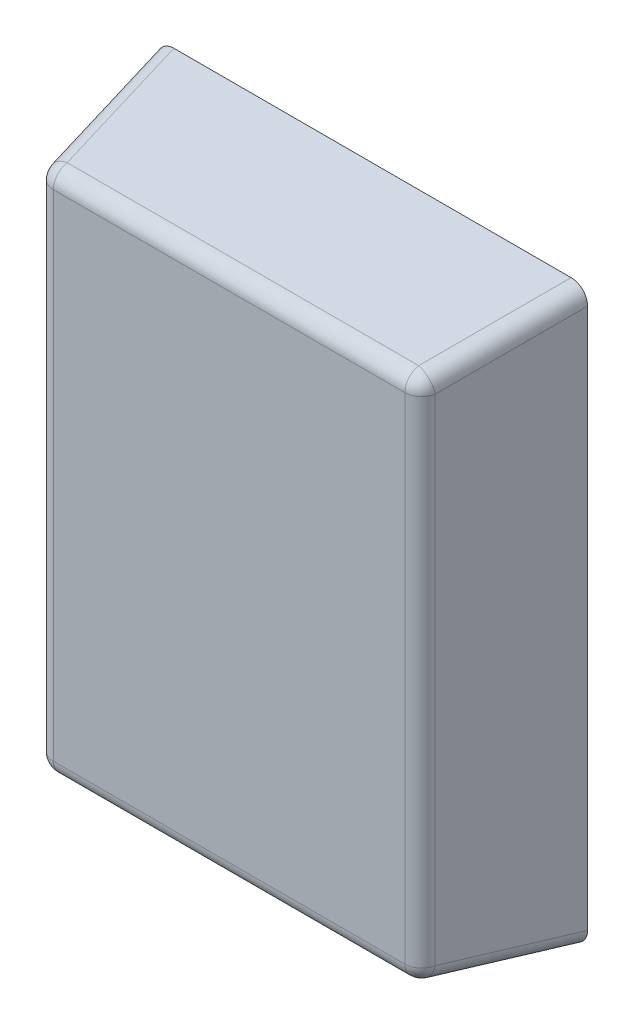
ISO-10303-21;
HEADER;
FILE_DESCRIPTION(('STEP AP214'),'2;1');
FILE_NAME('part.step','',(''),(''),'','','');
FILE_SCHEMA(('AUTOMOTIVE_DESIGN { 1 0 10303 214 1 1 1 1 }'));
ENDSEC;
DATA;
#1=APPLICATION_CONTEXT('core data for automotive mechanical design processes');
#2=APPLICATION_PROTOCOL_DEFINITION('international standard','automotive_design',2000,#1);
#3=PRODUCT_CONTEXT('',#1,'mechanical');
#4=PRODUCT('Part','Part','',(#3));
#5=PRODUCT_RELATED_PRODUCT_CATEGORY('part','',(#4));
#6=PRODUCT_DEFINITION_FORMATION('','',#4);
#7=PRODUCT_DEFINITION_CONTEXT('part definition',#1,'design');
#8=PRODUCT_DEFINITION('design','',#6,#7);
#9=PRODUCT_DEFINITION_SHAPE('','',#8);
#10=(LENGTH_UNIT() NAMED_UNIT(*) SI_UNIT(.MILLI.,.METRE.));
#11=(NAMED_UNIT(*) PLANE_ANGLE_UNIT() SI_UNIT($,.RADIAN.));
#12=(NAMED_UNIT(*) SI_UNIT($,.STERADIAN.) SOLID_ANGLE_UNIT());
#13=UNCERTAINTY_MEASURE_WITH_UNIT(LENGTH_MEASURE(1.E-05),#10,'distance_accuracy_value','');
#14=(GEOMETRIC_REPRESENTATION_CONTEXT(3) GLOBAL_UNCERTAINTY_ASSIGNED_CONTEXT((#13)) GLOBAL_UNIT_ASSIGNED_CONTEXT((#10,
#11,#12)) REPRESENTATION_CONTEXT('',''));
#15=CARTESIAN_POINT('',(0.,0.,0.));
#16=DIRECTION('',(0.,0.,1.));
#17=DIRECTION('',(1.,0.,0.));
#18=AXIS2_PLACEMENT_3D('',#15,#16,#17);
#19=CARTESIAN_POINT('',(-0.205464285309382,-0.641019643054923,0.245));
#20=DIRECTION('',(0.,0.,1.));
#21=DIRECTION('',(1.,0.,0.));
#22=AXIS2_PLACEMENT_3D('',#19,#20,#21);
#23=PLANE('',#22);
#24=DIRECTION('',(0.,1.,0.));
#25=VECTOR('',#24,1.);
#26=CARTESIAN_POINT('',(-0.131917601570131,-0.581022128259369,0.245));
#27=LINE('',#26,#25);
#28=CARTESIAN_POINT('',(-0.131917601570131,-0.537477929724562,0.245));
#29=VERTEX_POINT('',#28);
#30=CARTESIAN_POINT('',(-0.131917601570131,-0.744561356385284,0.245));
#31=VERTEX_POINT('',#30);
#32=EDGE_CURVE('E134',#29,#31,#27,.F.);
#33=ORIENTED_EDGE('',*,*,#32,.F.);
#34=DIRECTION('',(-1.,0.,0.));
#35=VECTOR('',#34,1.);
#36=CARTESIAN_POINT('',(-0.250464285309382,-0.537477929724562,0.245));
#37=LINE('',#36,#35);
#38=CARTESIAN_POINT('',(-0.279010969048634,-0.537477929724562,0.245));
#39=VERTEX_POINT('',#38);
#40=EDGE_CURVE('E237',#39,#29,#37,.F.);
#41=ORIENTED_EDGE('',*,*,#40,.F.);
#42=DIRECTION('',(0.,-1.,0.));
#43=VECTOR('',#42,1.);
#44=CARTESIAN_POINT('',(-0.279010969048634,-0.701017157850478,0.245));
#45=LINE('',#44,#43);
#46=CARTESIAN_POINT('',(-0.279010969048634,-0.744561356385284,0.245));
#47=VERTEX_POINT('',#46);
#48=EDGE_CURVE('E140',#47,#39,#45,.F.);
#49=ORIENTED_EDGE('',*,*,#48,.F.);
#50=DIRECTION('',(1.,0.,0.));
#51=VECTOR('',#50,1.);
#52=CARTESIAN_POINT('',(-0.160464285309382,-0.744561356385284,0.245));
#53=LINE('',#52,#51);
#54=EDGE_CURVE('E114',#31,#47,#53,.F.);
#55=ORIENTED_EDGE('',*,*,#54,.F.);
#56=EDGE_LOOP('',(#33,#41,#49,#55));
#57=FACE_BOUND('',#56,.T.);
#58=ADVANCED_FACE('F17',(#57),#23,.T.);
#59=CARTESIAN_POINT('',(-0.279010969048634,-0.701017157850478,0.238));
#60=DIRECTION('',(0.,-1.,0.));
#61=DIRECTION('',(1.,0.,0.));
#62=AXIS2_PLACEMENT_3D('',#59,#60,#61);
#63=CYLINDRICAL_SURFACE('',#62,0.007);
#64=DIRECTION('',(0.,1.,0.));
#65=VECTOR('',#64,1.);
#66=CARTESIAN_POINT('',(-0.28590462331972,-0.761014672646032,0.239215537243668));
#67=LINE('',#66,#65);
#68=CARTESIAN_POINT('',(-0.28590462331972,-0.744561356385283,0.239215537243668));
#69=VERTEX_POINT('',#68);
#70=CARTESIAN_POINT('',(-0.285904623319719,-0.537477929724562,0.239215537243668));
#71=VERTEX_POINT('',#70);
#72=EDGE_CURVE('E183',#69,#71,#67,.T.);
#73=ORIENTED_EDGE('',*,*,#72,.F.);
#74=CARTESIAN_POINT('',(-0.279010969048635,-0.744561356385283,0.238));
#75=DIRECTION('',(0.,-1.,-1.82015343698568E-13));
#76=DIRECTION('',(1.,0.,0.));
#77=AXIS2_PLACEMENT_3D('',#74,#75,#76);
#78=CIRCLE('',#77,0.007);
#79=EDGE_CURVE('E103',#47,#69,#78,.T.);
#80=ORIENTED_EDGE('',*,*,#79,.F.);
#81=ORIENTED_EDGE('',*,*,#48,.T.);
#82=CARTESIAN_POINT('',(-0.279010969048634,-0.537477929724562,0.238));
#83=DIRECTION('',(0.,-1.,0.));
#84=DIRECTION('',(1.,0.,0.));
#85=AXIS2_PLACEMENT_3D('',#82,#83,#84);
#86=CIRCLE('',#85,0.007);
#87=EDGE_CURVE('E90',#71,#39,#86,.F.);
#88=ORIENTED_EDGE('',*,*,#87,.F.);
#89=EDGE_LOOP('',(#73,#80,#81,#88));
#90=FACE_BOUND('',#89,.T.);
#91=ADVANCED_FACE('F229',(#90),#63,.T.);
#92=CARTESIAN_POINT('',(-0.279010969048635,-0.744561356385283,0.238));
#93=DIRECTION('',(1.,0.,0.));
#94=DIRECTION('',(0.,1.,0.));
#95=AXIS2_PLACEMENT_3D('',#92,#93,#94);
#96=SPHERICAL_SURFACE('',#95,0.007);
#97=ORIENTED_EDGE('',*,*,#79,.T.);
#98=CARTESIAN_POINT('',(-0.279010969048634,-0.744561356385283,0.237999999999999));
#99=DIRECTION('',(-0.171087869746035,-0.171087869746037,-0.970287525247814));
#100=DIRECTION('',(0.,0.984807753012208,-0.173648177666932));
#101=AXIS2_PLACEMENT_3D('',#98,#99,#100);
#102=CIRCLE('',#101,0.007);
#103=CARTESIAN_POINT('',(-0.279010969048635,-0.751455010656369,0.239215537243668));
#104=VERTEX_POINT('',#103);
#105=EDGE_CURVE('E20',#104,#69,#102,.T.);
#106=ORIENTED_EDGE('',*,*,#105,.F.);
#107=CARTESIAN_POINT('',(-0.279010969048634,-0.744561356385284,0.238));
#108=DIRECTION('',(1.,0.,0.));
#109=DIRECTION('',(0.,1.,0.));
#110=AXIS2_PLACEMENT_3D('',#107,#108,#109);
#111=CIRCLE('',#110,0.007);
#112=EDGE_CURVE('E122',#47,#104,#111,.T.);
#113=ORIENTED_EDGE('',*,*,#112,.F.);
#114=EDGE_LOOP('',(#97,#106,#113));
#115=FACE_BOUND('',#114,.T.);
#116=ADVANCED_FACE('F226',(#115),#96,.T.);
#117=CARTESIAN_POINT('',(-0.160464285309382,-0.744561356385284,0.238));
#118=DIRECTION('',(1.,0.,0.));
#119=DIRECTION('',(0.,1.,0.));
#120=AXIS2_PLACEMENT_3D('',#117,#118,#119);
#121=CYLINDRICAL_SURFACE('',#120,0.007);
#122=DIRECTION('',(1.,0.,0.));
#123=VECTOR('',#122,1.);
#124=CARTESIAN_POINT('',(-0.115464285309383,-0.75145501065637,0.239215537243668));
#125=LINE('',#124,#123);
#126=CARTESIAN_POINT('',(-0.131917601570131,-0.751455010656369,0.239215537243668));
#127=VERTEX_POINT('',#126);
#128=EDGE_CURVE('E117',#127,#104,#125,.F.);
#129=ORIENTED_EDGE('',*,*,#128,.F.);
#130=CARTESIAN_POINT('',(-0.131917601570131,-0.744561356385284,0.238));
#131=DIRECTION('',(1.,0.,0.));
#132=DIRECTION('',(0.,1.,0.));
#133=AXIS2_PLACEMENT_3D('',#130,#131,#132);
#134=CIRCLE('',#133,0.00699999999999995);
#135=EDGE_CURVE('E110',#31,#127,#134,.T.);
#136=ORIENTED_EDGE('',*,*,#135,.F.);
#137=ORIENTED_EDGE('',*,*,#54,.T.);
#138=ORIENTED_EDGE('',*,*,#112,.T.);
#139=EDGE_LOOP('',(#129,#136,#137,#138));
#140=FACE_BOUND('',#139,.T.);
#141=ADVANCED_FACE('F112',(#140),#121,.T.);
#142=CARTESIAN_POINT('',(-0.131917601570132,-0.744561356385284,0.238));
#143=DIRECTION('',(1.,0.,0.));
#144=DIRECTION('',(0.,1.,0.));
#145=AXIS2_PLACEMENT_3D('',#142,#143,#144);
#146=SPHERICAL_SURFACE('',#145,0.007);
#147=ORIENTED_EDGE('',*,*,#135,.T.);
#148=CARTESIAN_POINT('',(-0.131917601570132,-0.744561356385283,0.237999999999999));
#149=DIRECTION('',(0.171087869746039,-0.171087869746042,-0.970287525247812));
#150=DIRECTION('',(0.,0.984807753012207,-0.173648177666937));
#151=AXIS2_PLACEMENT_3D('',#148,#149,#150);
#152=CIRCLE('',#151,0.007);
#153=CARTESIAN_POINT('',(-0.125023947299046,-0.744561356385284,0.239215537243668));
#154=VERTEX_POINT('',#153);
#155=EDGE_CURVE('E126',#154,#127,#152,.T.);
#156=ORIENTED_EDGE('',*,*,#155,.F.);
#157=CARTESIAN_POINT('',(-0.131917601570131,-0.744561356385284,0.238));
#158=DIRECTION('',(0.,1.,0.));
#159=DIRECTION('',(-1.,0.,0.));
#160=AXIS2_PLACEMENT_3D('',#157,#158,#159);
#161=CIRCLE('',#160,0.007);
#162=EDGE_CURVE('E121',#31,#154,#161,.T.);
#163=ORIENTED_EDGE('',*,*,#162,.F.);
#164=EDGE_LOOP('',(#147,#156,#163));
#165=FACE_BOUND('',#164,.T.);
#166=ADVANCED_FACE('F125',(#165),#146,.T.);
#167=CARTESIAN_POINT('',(-0.131917601570131,-0.581022128259369,0.238));
#168=DIRECTION('',(0.,1.,0.));
#169=DIRECTION('',(-1.,0.,0.));
#170=AXIS2_PLACEMENT_3D('',#167,#168,#169);
#171=CYLINDRICAL_SURFACE('',#170,0.007);
#172=DIRECTION('',(0.,1.,0.));
#173=VECTOR('',#172,1.);
#174=CARTESIAN_POINT('',(-0.125023947299045,-0.521024613463814,0.239215537243668));
#175=LINE('',#174,#173);
#176=CARTESIAN_POINT('',(-0.125023947299045,-0.537477929724562,0.239215537243668));
#177=VERTEX_POINT('',#176);
#178=EDGE_CURVE('E165',#177,#154,#175,.F.);
#179=ORIENTED_EDGE('',*,*,#178,.F.);
#180=CARTESIAN_POINT('',(-0.131917601570131,-0.537477929724562,0.238));
#181=DIRECTION('',(0.,-1.,0.));
#182=DIRECTION('',(1.,0.,0.));
#183=AXIS2_PLACEMENT_3D('',#180,#181,#182);
#184=CIRCLE('',#183,0.007);
#185=EDGE_CURVE('E131',#29,#177,#184,.F.);
#186=ORIENTED_EDGE('',*,*,#185,.F.);
#187=ORIENTED_EDGE('',*,*,#32,.T.);
#188=ORIENTED_EDGE('',*,*,#162,.T.);
#189=EDGE_LOOP('',(#179,#186,#187,#188));
#190=FACE_BOUND('',#189,.T.);
#191=ADVANCED_FACE('F135',(#190),#171,.T.);
#192=CARTESIAN_POINT('',(-0.131917601570131,-0.537477929724562,0.238));
#193=DIRECTION('',(1.,0.,0.));
#194=DIRECTION('',(0.,1.,0.));
#195=AXIS2_PLACEMENT_3D('',#192,#193,#194);
#196=SPHERICAL_SURFACE('',#195,0.007);
#197=CARTESIAN_POINT('',(-0.131917601570131,-0.537477929724562,0.238));
#198=DIRECTION('',(-1.,0.,0.));
#199=DIRECTION('',(0.,-1.,0.));
#200=AXIS2_PLACEMENT_3D('',#197,#198,#199);
#201=CIRCLE('',#200,0.007);
#202=CARTESIAN_POINT('',(-0.131917601570131,-0.530584275453477,0.239215537243668));
#203=VERTEX_POINT('',#202);
#204=EDGE_CURVE('E216',#29,#203,#201,.T.);
#205=ORIENTED_EDGE('',*,*,#204,.F.);
#206=ORIENTED_EDGE('',*,*,#185,.T.);
#207=CARTESIAN_POINT('',(-0.131917601570131,-0.537477929724563,0.237999999999999));
#208=DIRECTION('',(0.17108786974604,0.171087869746041,-0.970287525247812));
#209=DIRECTION('',(0.,0.984807753012207,0.173648177666936));
#210=AXIS2_PLACEMENT_3D('',#207,#208,#209);
#211=CIRCLE('',#210,0.007);
#212=EDGE_CURVE('E162',#203,#177,#211,.T.);
#213=ORIENTED_EDGE('',*,*,#212,.F.);
#214=EDGE_LOOP('',(#205,#206,#213));
#215=FACE_BOUND('',#214,.T.);
#216=ADVANCED_FACE('F204',(#215),#196,.T.);
#217=CARTESIAN_POINT('',(-0.250464285309382,-0.537477929724562,0.238));
#218=DIRECTION('',(-1.,0.,0.));
#219=DIRECTION('',(0.,-1.,0.));
#220=AXIS2_PLACEMENT_3D('',#217,#218,#219);
#221=CYLINDRICAL_SURFACE('',#220,0.007);
#222=DIRECTION('',(1.,0.,0.));
#223=VECTOR('',#222,1.);
#224=CARTESIAN_POINT('',(-0.295464285309383,-0.530584275453476,0.239215537243668));
#225=LINE('',#224,#223);
#226=CARTESIAN_POINT('',(-0.279010969048634,-0.530584275453477,0.239215537243668));
#227=VERTEX_POINT('',#226);
#228=EDGE_CURVE('E163',#227,#203,#225,.T.);
#229=ORIENTED_EDGE('',*,*,#228,.F.);
#230=CARTESIAN_POINT('',(-0.279010969048634,-0.537477929724562,0.238));
#231=DIRECTION('',(1.,0.,0.));
#232=DIRECTION('',(0.,1.,0.));
#233=AXIS2_PLACEMENT_3D('',#230,#231,#232);
#234=CIRCLE('',#233,0.00699999999999995);
#235=EDGE_CURVE('E98',#39,#227,#234,.F.);
#236=ORIENTED_EDGE('',*,*,#235,.F.);
#237=ORIENTED_EDGE('',*,*,#40,.T.);
#238=ORIENTED_EDGE('',*,*,#204,.T.);
#239=EDGE_LOOP('',(#229,#236,#237,#238));
#240=FACE_BOUND('',#239,.T.);
#241=ADVANCED_FACE('F199',(#240),#221,.T.);
#242=CARTESIAN_POINT('',(-0.279010969048634,-0.537477929724562,0.238));
#243=DIRECTION('',(1.,0.,0.));
#244=DIRECTION('',(0.,1.,0.));
#245=AXIS2_PLACEMENT_3D('',#242,#243,#244);
#246=SPHERICAL_SURFACE('',#245,0.007);
#247=ORIENTED_EDGE('',*,*,#87,.T.);
#248=ORIENTED_EDGE('',*,*,#235,.T.);
#249=CARTESIAN_POINT('',(-0.279010969048634,-0.537477929724562,0.237999999999999));
#250=DIRECTION('',(-0.171087869746029,0.171087869746031,-0.970287525247816));
#251=DIRECTION('',(0.,0.984807753012209,0.173648177666926));
#252=AXIS2_PLACEMENT_3D('',#249,#250,#251);
#253=CIRCLE('',#252,0.007);
#254=EDGE_CURVE('E158',#71,#227,#253,.T.);
#255=ORIENTED_EDGE('',*,*,#254,.F.);
#256=EDGE_LOOP('',(#247,#248,#255));
#257=FACE_BOUND('',#256,.T.);
#258=ADVANCED_FACE('F194',(#257),#246,.T.);
#259=CARTESIAN_POINT('',(-0.295464285309383,-0.761014672646032,0.185));
#260=DIRECTION('',(-0.984807753012208,0.,0.173648177666928));
#261=DIRECTION('',(0.173648177666928,0.,0.984807753012208));
#262=AXIS2_PLACEMENT_3D('',#259,#260,#261);
#263=PLANE('',#262);
#264=DIRECTION('',(-0.171087869746035,-0.171087869746037,-0.970287525247814));
#265=VECTOR('',#264,1.);
#266=CARTESIAN_POINT('',(-0.293031674545797,-0.751688407611361,0.198796021197729));
#267=LINE('',#266,#265);
#268=CARTESIAN_POINT('',(-0.295464285309383,-0.754121018374946,0.185));
#269=VERTEX_POINT('',#268);
#270=EDGE_CURVE('E181',#69,#269,#267,.T.);
#271=ORIENTED_EDGE('',*,*,#270,.F.);
#272=ORIENTED_EDGE('',*,*,#72,.T.);
#273=DIRECTION('',(-0.171087869746032,0.171087869746027,-0.970287525247816));
#274=VECTOR('',#273,1.);
#275=CARTESIAN_POINT('',(-0.285904623319719,-0.537477929724562,0.239215537243668));
#276=LINE('',#275,#274);
#277=CARTESIAN_POINT('',(-0.295464285309383,-0.527918267734899,0.185));
#278=VERTEX_POINT('',#277);
#279=EDGE_CURVE('E186',#71,#278,#276,.T.);
#280=ORIENTED_EDGE('',*,*,#279,.T.);
#281=DIRECTION('',(0.,1.,0.));
#282=VECTOR('',#281,1.);
#283=CARTESIAN_POINT('',(-0.295464285309383,-0.641019643054923,0.185));
#284=LINE('',#283,#282);
#285=EDGE_CURVE('E155',#278,#269,#284,.F.);
#286=ORIENTED_EDGE('',*,*,#285,.T.);
#287=EDGE_LOOP('',(#271,#272,#280,#286));
#288=FACE_BOUND('',#287,.T.);
#289=ADVANCED_FACE('F198',(#288),#263,.T.);
#290=CARTESIAN_POINT('',(-0.286138020274712,-0.751688407611361,0.197580483954061));
#291=DIRECTION('',(-0.171087869746035,-0.171087869746037,-0.970287525247814));
#292=DIRECTION('',(0.,0.984807753012208,-0.173648177666932));
#293=AXIS2_PLACEMENT_3D('',#290,#291,#292);
#294=CYLINDRICAL_SURFACE('',#293,0.007);
#295=DIRECTION('',(-0.17108786974603,-0.171087869746038,-0.970287525247815));
#296=VECTOR('',#295,1.);
#297=CARTESIAN_POINT('',(-0.279010969048635,-0.751455010656369,0.239215537243668));
#298=LINE('',#297,#296);
#299=CARTESIAN_POINT('',(-0.288570631038298,-0.761014672646032,0.185));
#300=VERTEX_POINT('',#299);
#301=EDGE_CURVE('E172',#104,#300,#298,.T.);
#302=ORIENTED_EDGE('',*,*,#301,.F.);
#303=ORIENTED_EDGE('',*,*,#105,.T.);
#304=ORIENTED_EDGE('',*,*,#270,.T.);
#305=CARTESIAN_POINT('',(-0.288356299026183,-0.753906686362832,0.185));
#306=DIRECTION('',(0.,0.,1.));
#307=DIRECTION('',(-0.707106781186543,-0.707106781186552,0.));
#308=AXIS2_PLACEMENT_3D('',#305,#306,#307);
#309=ELLIPSE('',#308,0.00721435638184896,0.007);
#310=EDGE_CURVE('E153',#269,#300,#309,.T.);
#311=ORIENTED_EDGE('',*,*,#310,.T.);
#312=EDGE_LOOP('',(#302,#303,#304,#311));
#313=FACE_BOUND('',#312,.T.);
#314=ADVANCED_FACE('F273',(#313),#294,.T.);
#315=CARTESIAN_POINT('',(-0.115464285309383,-0.761014672646033,0.185));
#316=DIRECTION('',(0.,-0.984807753012208,0.173648177666931));
#317=DIRECTION('',(0.,-0.173648177666931,-0.984807753012208));
#318=AXIS2_PLACEMENT_3D('',#315,#316,#317);
#319=PLANE('',#318);
#320=DIRECTION('',(0.171087869746039,-0.171087869746042,-0.970287525247812));
#321=VECTOR('',#320,1.);
#322=CARTESIAN_POINT('',(-0.125668536630148,-0.757704075596352,0.203775328859929));
#323=LINE('',#322,#321);
#324=CARTESIAN_POINT('',(-0.122357939580468,-0.761014672646032,0.185));
#325=VERTEX_POINT('',#324);
#326=EDGE_CURVE('E166',#127,#325,#323,.T.);
#327=ORIENTED_EDGE('',*,*,#326,.F.);
#328=ORIENTED_EDGE('',*,*,#128,.T.);
#329=ORIENTED_EDGE('',*,*,#301,.T.);
#330=DIRECTION('',(1.,0.,0.));
#331=VECTOR('',#330,1.);
#332=CARTESIAN_POINT('',(-0.205464285309382,-0.761014672646032,0.185));
#333=LINE('',#332,#331);
#334=EDGE_CURVE('E152',#300,#325,#333,.T.);
#335=ORIENTED_EDGE('',*,*,#334,.T.);
#336=EDGE_LOOP('',(#327,#328,#329,#335));
#337=FACE_BOUND('',#336,.T.);
#338=ADVANCED_FACE('F272',(#337),#319,.T.);
#339=CARTESIAN_POINT('',(-0.125668536630148,-0.750810421325267,0.202559791616261));
#340=DIRECTION('',(0.171087869746039,-0.171087869746042,-0.970287525247812));
#341=DIRECTION('',(0.,0.984807753012207,-0.173648177666937));
#342=AXIS2_PLACEMENT_3D('',#339,#340,#341);
#343=CYLINDRICAL_SURFACE('',#342,0.007);
#344=DIRECTION('',(0.171087869746034,-0.171087869746032,-0.970287525247815));
#345=VECTOR('',#344,1.);
#346=CARTESIAN_POINT('',(-0.125023947299046,-0.744561356385284,0.239215537243668));
#347=LINE('',#346,#345);
#348=CARTESIAN_POINT('',(-0.115464285309383,-0.754121018374947,0.185));
#349=VERTEX_POINT('',#348);
#350=EDGE_CURVE('E168',#154,#349,#347,.T.);
#351=ORIENTED_EDGE('',*,*,#350,.F.);
#352=ORIENTED_EDGE('',*,*,#155,.T.);
#353=ORIENTED_EDGE('',*,*,#326,.T.);
#354=CARTESIAN_POINT('',(-0.122572271592583,-0.753906686362832,0.185));
#355=DIRECTION('',(0.,0.,1.));
#356=DIRECTION('',(0.707106781186541,-0.707106781186554,0.));
#357=AXIS2_PLACEMENT_3D('',#354,#355,#356);
#358=ELLIPSE('',#357,0.00721435638184897,0.007);
#359=EDGE_CURVE('E150',#325,#349,#358,.T.);
#360=ORIENTED_EDGE('',*,*,#359,.T.);
#361=EDGE_LOOP('',(#351,#352,#353,#360));
#362=FACE_BOUND('',#361,.T.);
#363=ADVANCED_FACE('F293',(#362),#343,.T.);
#364=CARTESIAN_POINT('',(-0.115464285309382,-0.521024613463814,0.185));
#365=DIRECTION('',(0.984807753012208,0.,0.173648177666929));
#366=DIRECTION('',(0.173648177666929,0.,-0.984807753012208));
#367=AXIS2_PLACEMENT_3D('',#364,#365,#366);
#368=PLANE('',#367);
#369=ORIENTED_EDGE('',*,*,#350,.T.);
#370=DIRECTION('',(0.,1.,0.));
#371=VECTOR('',#370,1.);
#372=CARTESIAN_POINT('',(-0.115464285309383,-0.641019643054923,0.185));
#373=LINE('',#372,#371);
#374=CARTESIAN_POINT('',(-0.115464285309382,-0.527918267734899,0.185));
#375=VERTEX_POINT('',#374);
#376=EDGE_CURVE('E149',#349,#375,#373,.T.);
#377=ORIENTED_EDGE('',*,*,#376,.T.);
#378=DIRECTION('',(0.17108786974604,0.171087869746041,-0.970287525247812));
#379=VECTOR('',#378,1.);
#380=CARTESIAN_POINT('',(-0.117896896072968,-0.530350878498484,0.19879602119773));
#381=LINE('',#380,#379);
#382=EDGE_CURVE('E164',#177,#375,#381,.T.);
#383=ORIENTED_EDGE('',*,*,#382,.F.);
#384=ORIENTED_EDGE('',*,*,#178,.T.);
#385=EDGE_LOOP('',(#369,#377,#383,#384));
#386=FACE_BOUND('',#385,.T.);
#387=ADVANCED_FACE('F267',(#386),#368,.T.);
#388=CARTESIAN_POINT('',(-0.124790550344053,-0.530350878498485,0.197580483954061));
#389=DIRECTION('',(0.17108786974604,0.171087869746041,-0.970287525247812));
#390=DIRECTION('',(0.,0.984807753012207,0.173648177666936));
#391=AXIS2_PLACEMENT_3D('',#388,#389,#390);
#392=CYLINDRICAL_SURFACE('',#391,0.007);
#393=DIRECTION('',(0.17108786974603,0.171087869746036,-0.970287525247815));
#394=VECTOR('',#393,1.);
#395=CARTESIAN_POINT('',(-0.131917601570131,-0.530584275453476,0.239215537243668));
#396=LINE('',#395,#394);
#397=CARTESIAN_POINT('',(-0.122357939580468,-0.521024613463814,0.185));
#398=VERTEX_POINT('',#397);
#399=EDGE_CURVE('E161',#203,#398,#396,.T.);
#400=ORIENTED_EDGE('',*,*,#399,.F.);
#401=ORIENTED_EDGE('',*,*,#212,.T.);
#402=ORIENTED_EDGE('',*,*,#382,.T.);
#403=CARTESIAN_POINT('',(-0.122572271592582,-0.528132599747014,0.185));
#404=DIRECTION('',(0.,0.,1.));
#405=DIRECTION('',(0.707106781186545,0.70710678118655,0.));
#406=AXIS2_PLACEMENT_3D('',#403,#404,#405);
#407=ELLIPSE('',#406,0.00721435638184897,0.007);
#408=EDGE_CURVE('E26',#375,#398,#407,.T.);
#409=ORIENTED_EDGE('',*,*,#408,.T.);
#410=EDGE_LOOP('',(#400,#401,#402,#409));
#411=FACE_BOUND('',#410,.T.);
#412=ADVANCED_FACE('F257',(#411),#392,.T.);
#413=CARTESIAN_POINT('',(-0.295464285309383,-0.521024613463813,0.185));
#414=DIRECTION('',(0.,0.984807753012208,0.17364817766693));
#415=DIRECTION('',(0.,-0.17364817766693,0.984807753012208));
#416=AXIS2_PLACEMENT_3D('',#413,#414,#415);
#417=PLANE('',#416);
#418=ORIENTED_EDGE('',*,*,#399,.T.);
#419=DIRECTION('',(1.,0.,0.));
#420=VECTOR('',#419,1.);
#421=CARTESIAN_POINT('',(-0.205464285309382,-0.521024613463814,0.185));
#422=LINE('',#421,#420);
#423=CARTESIAN_POINT('',(-0.288570631038297,-0.521024613463814,0.185));
#424=VERTEX_POINT('',#423);
#425=EDGE_CURVE('E11',#398,#424,#422,.F.);
#426=ORIENTED_EDGE('',*,*,#425,.T.);
#427=DIRECTION('',(-0.171087869746029,0.171087869746031,-0.970287525247816));
#428=VECTOR('',#427,1.);
#429=CARTESIAN_POINT('',(-0.285260033988617,-0.524335210513494,0.203775328859929));
#430=LINE('',#429,#428);
#431=EDGE_CURVE('E157',#227,#424,#430,.T.);
#432=ORIENTED_EDGE('',*,*,#431,.F.);
#433=ORIENTED_EDGE('',*,*,#228,.T.);
#434=EDGE_LOOP('',(#418,#426,#432,#433));
#435=FACE_BOUND('',#434,.T.);
#436=ADVANCED_FACE('F254',(#435),#417,.T.);
#437=CARTESIAN_POINT('',(-0.285260033988617,-0.531228864784579,0.202559791616261));
#438=DIRECTION('',(-0.171087869746029,0.171087869746031,-0.970287525247816));
#439=DIRECTION('',(0.,0.984807753012209,0.173648177666926));
#440=AXIS2_PLACEMENT_3D('',#437,#438,#439);
#441=CYLINDRICAL_SURFACE('',#440,0.007);
#442=ORIENTED_EDGE('',*,*,#431,.T.);
#443=CARTESIAN_POINT('',(-0.288356299026182,-0.528132599747014,0.185));
#444=DIRECTION('',(0.,0.,1.));
#445=DIRECTION('',(-0.707106781186543,0.707106781186552,0.));
#446=AXIS2_PLACEMENT_3D('',#443,#444,#445);
#447=ELLIPSE('',#446,0.00721435638184894,0.007);
#448=EDGE_CURVE('E35',#424,#278,#447,.T.);
#449=ORIENTED_EDGE('',*,*,#448,.T.);
#450=ORIENTED_EDGE('',*,*,#279,.F.);
#451=ORIENTED_EDGE('',*,*,#254,.T.);
#452=EDGE_LOOP('',(#442,#449,#450,#451));
#453=FACE_BOUND('',#452,.T.);
#454=ADVANCED_FACE('F278',(#453),#441,.T.);
#455=CARTESIAN_POINT('',(-0.205464285309382,-0.641019643054923,0.185));
#456=DIRECTION('',(0.,0.,1.));
#457=DIRECTION('',(1.,0.,0.));
#458=AXIS2_PLACEMENT_3D('',#455,#456,#457);
#459=PLANE('',#458);
#460=ORIENTED_EDGE('',*,*,#425,.F.);
#461=ORIENTED_EDGE('',*,*,#408,.F.);
#462=ORIENTED_EDGE('',*,*,#376,.F.);
#463=ORIENTED_EDGE('',*,*,#359,.F.);
#464=ORIENTED_EDGE('',*,*,#334,.F.);
#465=ORIENTED_EDGE('',*,*,#310,.F.);
#466=ORIENTED_EDGE('',*,*,#285,.F.);
#467=ORIENTED_EDGE('',*,*,#448,.F.);
#468=EDGE_LOOP('',(#460,#461,#462,#463,#464,#465,#466,#467));
#469=FACE_BOUND('',#468,.T.);
#470=ADVANCED_FACE('F268',(#469),#459,.F.);
#471=CLOSED_SHELL('',(#58,#91,#116,#141,#166,#191,#216,#241,#258,#289,#314,#338,#363,#387,#412,
#436,#454,#470));
#472=MANIFOLD_SOLID_BREP('B1',#471);
#473=ADVANCED_BREP_SHAPE_REPRESENTATION('',(#18,#472),#14);
#474=SHAPE_DEFINITION_REPRESENTATION(#9,#473);
ENDSEC;
END-ISO-10303-21;
